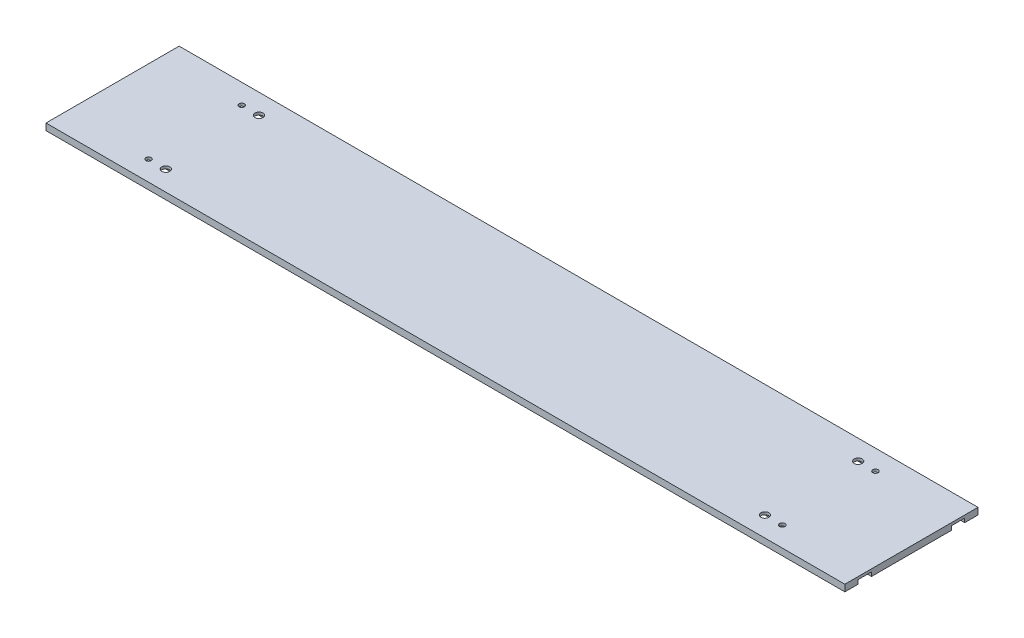
ISO-10303-21;
HEADER;
FILE_DESCRIPTION(('STEP AP214'),'2;1');
FILE_NAME('part.step','',(''),(''),'','','');
FILE_SCHEMA(('AUTOMOTIVE_DESIGN { 1 0 10303 214 1 1 1 1 }'));
ENDSEC;
DATA;
#1=APPLICATION_CONTEXT('core data for automotive mechanical design processes');
#2=APPLICATION_PROTOCOL_DEFINITION('international standard','automotive_design',2000,#1);
#3=PRODUCT_CONTEXT('',#1,'mechanical');
#4=PRODUCT('Part','Part','',(#3));
#5=PRODUCT_RELATED_PRODUCT_CATEGORY('part','',(#4));
#6=PRODUCT_DEFINITION_FORMATION('','',#4);
#7=PRODUCT_DEFINITION_CONTEXT('part definition',#1,'design');
#8=PRODUCT_DEFINITION('design','',#6,#7);
#9=PRODUCT_DEFINITION_SHAPE('','',#8);
#10=(LENGTH_UNIT() NAMED_UNIT(*) SI_UNIT(.MILLI.,.METRE.));
#11=(NAMED_UNIT(*) PLANE_ANGLE_UNIT() SI_UNIT($,.RADIAN.));
#12=(NAMED_UNIT(*) SI_UNIT($,.STERADIAN.) SOLID_ANGLE_UNIT());
#13=UNCERTAINTY_MEASURE_WITH_UNIT(LENGTH_MEASURE(1.E-05),#10,'distance_accuracy_value','');
#14=(GEOMETRIC_REPRESENTATION_CONTEXT(3) GLOBAL_UNCERTAINTY_ASSIGNED_CONTEXT((#13)) GLOBAL_UNIT_ASSIGNED_CONTEXT((#10,
#11,#12)) REPRESENTATION_CONTEXT('',''));
#15=CARTESIAN_POINT('',(0.,0.,0.));
#16=DIRECTION('',(0.,0.,1.));
#17=DIRECTION('',(1.,0.,0.));
#18=AXIS2_PLACEMENT_3D('',#15,#16,#17);
#19=CARTESIAN_POINT('',(0.,0.,-100.));
#20=DIRECTION('',(0.,-1.,0.));
#21=DIRECTION('',(0.,0.,-1.));
#22=AXIS2_PLACEMENT_3D('',#19,#20,#21);
#23=PLANE('',#22);
#24=DIRECTION('',(-1.,0.,0.));
#25=VECTOR('',#24,1.);
#26=CARTESIAN_POINT('',(0.,0.,-80.));
#27=LINE('',#26,#25);
#28=CARTESIAN_POINT('',(600.,0.,-80.));
#29=VERTEX_POINT('',#28);
#30=CARTESIAN_POINT('',(0.,0.,-80.));
#31=VERTEX_POINT('',#30);
#32=EDGE_CURVE('E135',#29,#31,#27,.T.);
#33=ORIENTED_EDGE('',*,*,#32,.F.);
#34=DIRECTION('',(0.,0.,1.));
#35=VECTOR('',#34,1.);
#36=CARTESIAN_POINT('',(600.,0.,-100.));
#37=LINE('',#36,#35);
#38=CARTESIAN_POINT('',(600.,0.,-20.));
#39=VERTEX_POINT('',#38);
#40=EDGE_CURVE('E306',#29,#39,#37,.T.);
#41=ORIENTED_EDGE('',*,*,#40,.T.);
#42=DIRECTION('',(1.,0.,0.));
#43=VECTOR('',#42,1.);
#44=CARTESIAN_POINT('',(600.,0.,-20.));
#45=LINE('',#44,#43);
#46=CARTESIAN_POINT('',(0.,0.,-20.));
#47=VERTEX_POINT('',#46);
#48=EDGE_CURVE('E194',#47,#39,#45,.T.);
#49=ORIENTED_EDGE('',*,*,#48,.F.);
#50=DIRECTION('',(0.,0.,1.));
#51=VECTOR('',#50,1.);
#52=CARTESIAN_POINT('',(0.,0.,-100.));
#53=LINE('',#52,#51);
#54=EDGE_CURVE('E310',#31,#47,#53,.T.);
#55=ORIENTED_EDGE('',*,*,#54,.F.);
#56=EDGE_LOOP('',(#33,#41,#49,#55));
#57=FACE_BOUND('',#56,.T.);
#58=ADVANCED_FACE('F39',(#57),#23,.T.);
#59=DIRECTION('',(-1.,0.,0.));
#60=VECTOR('',#59,1.);
#61=CARTESIAN_POINT('',(0.,0.,-10.));
#62=LINE('',#61,#60);
#63=CARTESIAN_POINT('',(600.,0.,-10.));
#64=VERTEX_POINT('',#63);
#65=CARTESIAN_POINT('',(0.,0.,-10.));
#66=VERTEX_POINT('',#65);
#67=EDGE_CURVE('E183',#64,#66,#62,.T.);
#68=ORIENTED_EDGE('',*,*,#67,.F.);
#69=CARTESIAN_POINT('',(600.,0.,0.));
#70=VERTEX_POINT('',#69);
#71=EDGE_CURVE('E307',#64,#70,#37,.T.);
#72=ORIENTED_EDGE('',*,*,#71,.T.);
#73=DIRECTION('',(1.,0.,0.));
#74=VECTOR('',#73,1.);
#75=CARTESIAN_POINT('',(0.,0.,0.));
#76=LINE('',#75,#74);
#77=CARTESIAN_POINT('',(0.,0.,0.));
#78=VERTEX_POINT('',#77);
#79=EDGE_CURVE('E289',#78,#70,#76,.T.);
#80=ORIENTED_EDGE('',*,*,#79,.F.);
#81=EDGE_CURVE('E285',#66,#78,#53,.T.);
#82=ORIENTED_EDGE('',*,*,#81,.F.);
#83=EDGE_LOOP('',(#68,#72,#80,#82));
#84=FACE_BOUND('',#83,.T.);
#85=ADVANCED_FACE('F365',(#84),#23,.T.);
#86=CARTESIAN_POINT('',(0.,4.99999999999994,-100.));
#87=DIRECTION('',(-1.,0.,0.));
#88=DIRECTION('',(0.,-1.,0.));
#89=AXIS2_PLACEMENT_3D('',#86,#87,#88);
#90=PLANE('',#89);
#91=DIRECTION('',(0.,-1.,0.));
#92=VECTOR('',#91,1.);
#93=CARTESIAN_POINT('',(0.,3.,-80.));
#94=LINE('',#93,#92);
#95=CARTESIAN_POINT('',(0.,3.,-80.));
#96=VERTEX_POINT('',#95);
#97=EDGE_CURVE('E129',#96,#31,#94,.T.);
#98=ORIENTED_EDGE('',*,*,#97,.T.);
#99=ORIENTED_EDGE('',*,*,#54,.T.);
#100=DIRECTION('',(0.,-1.,0.));
#101=VECTOR('',#100,1.);
#102=CARTESIAN_POINT('',(0.,3.,-20.));
#103=LINE('',#102,#101);
#104=CARTESIAN_POINT('',(0.,3.,-20.));
#105=VERTEX_POINT('',#104);
#106=EDGE_CURVE('E57',#105,#47,#103,.T.);
#107=ORIENTED_EDGE('',*,*,#106,.F.);
#108=DIRECTION('',(0.,0.,-1.));
#109=VECTOR('',#108,1.);
#110=CARTESIAN_POINT('',(0.,3.,-10.));
#111=LINE('',#110,#109);
#112=CARTESIAN_POINT('',(0.,3.,-10.));
#113=VERTEX_POINT('',#112);
#114=EDGE_CURVE('E178',#113,#105,#111,.T.);
#115=ORIENTED_EDGE('',*,*,#114,.F.);
#116=DIRECTION('',(0.,-1.,0.));
#117=VECTOR('',#116,1.);
#118=CARTESIAN_POINT('',(0.,3.,-10.));
#119=LINE('',#118,#117);
#120=EDGE_CURVE('E165',#113,#66,#119,.T.);
#121=ORIENTED_EDGE('',*,*,#120,.T.);
#122=ORIENTED_EDGE('',*,*,#81,.T.);
#123=DIRECTION('',(0.,-1.,0.));
#124=VECTOR('',#123,1.);
#125=CARTESIAN_POINT('',(0.,4.99999999999994,0.));
#126=LINE('',#125,#124);
#127=CARTESIAN_POINT('',(0.,4.99999999999994,0.));
#128=VERTEX_POINT('',#127);
#129=EDGE_CURVE('E267',#128,#78,#126,.T.);
#130=ORIENTED_EDGE('',*,*,#129,.F.);
#131=DIRECTION('',(0.,0.,1.));
#132=VECTOR('',#131,1.);
#133=CARTESIAN_POINT('',(0.,4.99999999999994,-100.));
#134=LINE('',#133,#132);
#135=CARTESIAN_POINT('',(0.,4.99999999999994,-100.));
#136=VERTEX_POINT('',#135);
#137=EDGE_CURVE('E11',#136,#128,#134,.T.);
#138=ORIENTED_EDGE('',*,*,#137,.F.);
#139=DIRECTION('',(0.,-1.,0.));
#140=VECTOR('',#139,1.);
#141=CARTESIAN_POINT('',(0.,4.99999999999994,-100.));
#142=LINE('',#141,#140);
#143=CARTESIAN_POINT('',(0.,0.,-100.));
#144=VERTEX_POINT('',#143);
#145=EDGE_CURVE('E268',#136,#144,#142,.T.);
#146=ORIENTED_EDGE('',*,*,#145,.T.);
#147=CARTESIAN_POINT('',(0.,0.,-90.));
#148=VERTEX_POINT('',#147);
#149=EDGE_CURVE('E308',#144,#148,#53,.T.);
#150=ORIENTED_EDGE('',*,*,#149,.T.);
#151=DIRECTION('',(0.,-1.,0.));
#152=VECTOR('',#151,1.);
#153=CARTESIAN_POINT('',(0.,3.,-90.));
#154=LINE('',#153,#152);
#155=CARTESIAN_POINT('',(0.,3.,-90.));
#156=VERTEX_POINT('',#155);
#157=EDGE_CURVE('E65',#156,#148,#154,.T.);
#158=ORIENTED_EDGE('',*,*,#157,.F.);
#159=DIRECTION('',(0.,0.,-1.));
#160=VECTOR('',#159,1.);
#161=CARTESIAN_POINT('',(0.,3.,-80.));
#162=LINE('',#161,#160);
#163=EDGE_CURVE('E148',#96,#156,#162,.T.);
#164=ORIENTED_EDGE('',*,*,#163,.F.);
#165=EDGE_LOOP('',(#98,#99,#107,#115,#121,#122,#130,#138,#146,#150,#158,#164));
#166=FACE_BOUND('',#165,.T.);
#167=ADVANCED_FACE('F41',(#166),#90,.T.);
#168=CARTESIAN_POINT('',(600.,5.,-100.));
#169=DIRECTION('',(0.,1.,0.));
#170=DIRECTION('',(-1.,0.,0.));
#171=AXIS2_PLACEMENT_3D('',#168,#169,#170);
#172=PLANE('',#171);
#173=CARTESIAN_POINT('',(74.9999999999999,4.99999999999994,-15.));
#174=DIRECTION('',(0.,1.,0.));
#175=DIRECTION('',(-1.,0.,0.));
#176=AXIS2_PLACEMENT_3D('',#173,#174,#175);
#177=CIRCLE('',#176,3.00000000000001);
#178=CARTESIAN_POINT('',(71.9999999999999,4.99999999999994,-15.));
#179=VERTEX_POINT('',#178);
#180=EDGE_CURVE('E240',#179,#179,#177,.T.);
#181=ORIENTED_EDGE('',*,*,#180,.F.);
#182=EDGE_LOOP('',(#181));
#183=FACE_BOUND('',#182,.T.);
#184=CARTESIAN_POINT('',(525.,4.99999999999999,-85.));
#185=DIRECTION('',(0.,1.,0.));
#186=DIRECTION('',(-1.,0.,0.));
#187=AXIS2_PLACEMENT_3D('',#184,#185,#186);
#188=CIRCLE('',#187,3.00000000000005);
#189=CARTESIAN_POINT('',(522.,4.99999999999999,-85.));
#190=VERTEX_POINT('',#189);
#191=EDGE_CURVE('E239',#190,#190,#188,.T.);
#192=ORIENTED_EDGE('',*,*,#191,.F.);
#193=EDGE_LOOP('',(#192));
#194=FACE_BOUND('',#193,.T.);
#195=CARTESIAN_POINT('',(525.,4.99999999999999,-15.));
#196=DIRECTION('',(0.,1.,0.));
#197=DIRECTION('',(-1.,0.,0.));
#198=AXIS2_PLACEMENT_3D('',#195,#196,#197);
#199=CIRCLE('',#198,3.00000000000005);
#200=CARTESIAN_POINT('',(522.,4.99999999999999,-15.));
#201=VERTEX_POINT('',#200);
#202=EDGE_CURVE('E235',#201,#201,#199,.T.);
#203=ORIENTED_EDGE('',*,*,#202,.F.);
#204=EDGE_LOOP('',(#203));
#205=FACE_BOUND('',#204,.T.);
#206=CARTESIAN_POINT('',(74.9999999999999,4.99999999999994,-85.));
#207=DIRECTION('',(0.,1.,0.));
#208=DIRECTION('',(-1.,0.,0.));
#209=AXIS2_PLACEMENT_3D('',#206,#207,#208);
#210=CIRCLE('',#209,3.00000000000001);
#211=CARTESIAN_POINT('',(71.9999999999999,4.99999999999994,-85.));
#212=VERTEX_POINT('',#211);
#213=EDGE_CURVE('E244',#212,#212,#210,.T.);
#214=ORIENTED_EDGE('',*,*,#213,.F.);
#215=EDGE_LOOP('',(#214));
#216=FACE_BOUND('',#215,.T.);
#217=CARTESIAN_POINT('',(62.,4.99999999999994,-15.));
#218=DIRECTION('',(0.,1.,0.));
#219=DIRECTION('',(-1.,0.,0.));
#220=AXIS2_PLACEMENT_3D('',#217,#218,#219);
#221=CIRCLE('',#220,2.);
#222=CARTESIAN_POINT('',(60.,4.99999999999994,-15.));
#223=VERTEX_POINT('',#222);
#224=EDGE_CURVE('E256',#223,#223,#221,.T.);
#225=ORIENTED_EDGE('',*,*,#224,.F.);
#226=EDGE_LOOP('',(#225));
#227=FACE_BOUND('',#226,.T.);
#228=CARTESIAN_POINT('',(538.,4.99999999999999,-85.));
#229=DIRECTION('',(0.,1.,0.));
#230=DIRECTION('',(-1.,0.,0.));
#231=AXIS2_PLACEMENT_3D('',#228,#229,#230);
#232=CIRCLE('',#231,2.);
#233=CARTESIAN_POINT('',(536.,4.99999999999999,-85.));
#234=VERTEX_POINT('',#233);
#235=EDGE_CURVE('E255',#234,#234,#232,.T.);
#236=ORIENTED_EDGE('',*,*,#235,.F.);
#237=EDGE_LOOP('',(#236));
#238=FACE_BOUND('',#237,.T.);
#239=CARTESIAN_POINT('',(538.,4.99999999999999,-15.));
#240=DIRECTION('',(0.,1.,0.));
#241=DIRECTION('',(-1.,0.,0.));
#242=AXIS2_PLACEMENT_3D('',#239,#240,#241);
#243=CIRCLE('',#242,2.);
#244=CARTESIAN_POINT('',(536.,4.99999999999999,-15.));
#245=VERTEX_POINT('',#244);
#246=EDGE_CURVE('E251',#245,#245,#243,.T.);
#247=ORIENTED_EDGE('',*,*,#246,.F.);
#248=EDGE_LOOP('',(#247));
#249=FACE_BOUND('',#248,.T.);
#250=CARTESIAN_POINT('',(61.9999999999999,4.99999999999994,-85.));
#251=DIRECTION('',(0.,1.,0.));
#252=DIRECTION('',(-1.,0.,0.));
#253=AXIS2_PLACEMENT_3D('',#250,#251,#252);
#254=CIRCLE('',#253,2.);
#255=CARTESIAN_POINT('',(59.9999999999999,4.99999999999994,-85.));
#256=VERTEX_POINT('',#255);
#257=EDGE_CURVE('E260',#256,#256,#254,.T.);
#258=ORIENTED_EDGE('',*,*,#257,.F.);
#259=EDGE_LOOP('',(#258));
#260=FACE_BOUND('',#259,.T.);
#261=DIRECTION('',(-1.,0.,0.));
#262=VECTOR('',#261,1.);
#263=CARTESIAN_POINT('',(600.,5.,0.));
#264=LINE('',#263,#262);
#265=CARTESIAN_POINT('',(600.,5.,0.));
#266=VERTEX_POINT('',#265);
#267=EDGE_CURVE('E273',#266,#128,#264,.T.);
#268=ORIENTED_EDGE('',*,*,#267,.F.);
#269=DIRECTION('',(0.,0.,1.));
#270=VECTOR('',#269,1.);
#271=CARTESIAN_POINT('',(600.,5.,-100.));
#272=LINE('',#271,#270);
#273=CARTESIAN_POINT('',(600.,5.,-100.));
#274=VERTEX_POINT('',#273);
#275=EDGE_CURVE('E49',#274,#266,#272,.T.);
#276=ORIENTED_EDGE('',*,*,#275,.F.);
#277=DIRECTION('',(-1.,0.,0.));
#278=VECTOR('',#277,1.);
#279=CARTESIAN_POINT('',(600.,5.,-100.));
#280=LINE('',#279,#278);
#281=EDGE_CURVE('E281',#274,#136,#280,.T.);
#282=ORIENTED_EDGE('',*,*,#281,.T.);
#283=ORIENTED_EDGE('',*,*,#137,.T.);
#284=EDGE_LOOP('',(#268,#276,#282,#283));
#285=FACE_BOUND('',#284,.T.);
#286=ADVANCED_FACE('F338',(#183,#194,#205,#216,#227,#238,#249,#260,#285),#172,.T.);
#287=CARTESIAN_POINT('',(600.,0.,-100.));
#288=DIRECTION('',(1.,0.,0.));
#289=DIRECTION('',(0.,0.,-1.));
#290=AXIS2_PLACEMENT_3D('',#287,#288,#289);
#291=PLANE('',#290);
#292=DIRECTION('',(0.,-1.,0.));
#293=VECTOR('',#292,1.);
#294=CARTESIAN_POINT('',(600.,3.,-80.));
#295=LINE('',#294,#293);
#296=CARTESIAN_POINT('',(600.,3.,-80.));
#297=VERTEX_POINT('',#296);
#298=EDGE_CURVE('E168',#297,#29,#295,.T.);
#299=ORIENTED_EDGE('',*,*,#298,.F.);
#300=DIRECTION('',(0.,0.,1.));
#301=VECTOR('',#300,1.);
#302=CARTESIAN_POINT('',(600.,3.,-80.));
#303=LINE('',#302,#301);
#304=CARTESIAN_POINT('',(600.,3.,-90.));
#305=VERTEX_POINT('',#304);
#306=EDGE_CURVE('E141',#305,#297,#303,.T.);
#307=ORIENTED_EDGE('',*,*,#306,.F.);
#308=DIRECTION('',(0.,-1.,0.));
#309=VECTOR('',#308,1.);
#310=CARTESIAN_POINT('',(600.,3.,-90.));
#311=LINE('',#310,#309);
#312=CARTESIAN_POINT('',(600.,0.,-90.));
#313=VERTEX_POINT('',#312);
#314=EDGE_CURVE('E172',#305,#313,#311,.T.);
#315=ORIENTED_EDGE('',*,*,#314,.T.);
#316=CARTESIAN_POINT('',(600.,0.,-100.));
#317=VERTEX_POINT('',#316);
#318=EDGE_CURVE('E302',#317,#313,#37,.T.);
#319=ORIENTED_EDGE('',*,*,#318,.F.);
#320=DIRECTION('',(0.,1.,0.));
#321=VECTOR('',#320,1.);
#322=CARTESIAN_POINT('',(600.,0.,-100.));
#323=LINE('',#322,#321);
#324=EDGE_CURVE('E277',#317,#274,#323,.T.);
#325=ORIENTED_EDGE('',*,*,#324,.T.);
#326=ORIENTED_EDGE('',*,*,#275,.T.);
#327=DIRECTION('',(0.,1.,0.));
#328=VECTOR('',#327,1.);
#329=CARTESIAN_POINT('',(600.,0.,0.));
#330=LINE('',#329,#328);
#331=EDGE_CURVE('E293',#70,#266,#330,.T.);
#332=ORIENTED_EDGE('',*,*,#331,.F.);
#333=ORIENTED_EDGE('',*,*,#71,.F.);
#334=DIRECTION('',(0.,-1.,0.));
#335=VECTOR('',#334,1.);
#336=CARTESIAN_POINT('',(600.,3.,-10.));
#337=LINE('',#336,#335);
#338=CARTESIAN_POINT('',(600.,3.,-10.));
#339=VERTEX_POINT('',#338);
#340=EDGE_CURVE('E202',#339,#64,#337,.T.);
#341=ORIENTED_EDGE('',*,*,#340,.F.);
#342=DIRECTION('',(0.,0.,1.));
#343=VECTOR('',#342,1.);
#344=CARTESIAN_POINT('',(600.,3.,-10.));
#345=LINE('',#344,#343);
#346=CARTESIAN_POINT('',(600.,3.,-20.));
#347=VERTEX_POINT('',#346);
#348=EDGE_CURVE('E187',#347,#339,#345,.T.);
#349=ORIENTED_EDGE('',*,*,#348,.F.);
#350=DIRECTION('',(0.,-1.,0.));
#351=VECTOR('',#350,1.);
#352=CARTESIAN_POINT('',(600.,3.,-20.));
#353=LINE('',#352,#351);
#354=EDGE_CURVE('E205',#347,#39,#353,.T.);
#355=ORIENTED_EDGE('',*,*,#354,.T.);
#356=ORIENTED_EDGE('',*,*,#40,.F.);
#357=EDGE_LOOP('',(#299,#307,#315,#319,#325,#326,#332,#333,#341,#349,#355,#356));
#358=FACE_BOUND('',#357,.T.);
#359=ADVANCED_FACE('F341',(#358),#291,.T.);
#360=DIRECTION('',(1.,0.,0.));
#361=VECTOR('',#360,1.);
#362=CARTESIAN_POINT('',(0.,0.,-90.));
#363=LINE('',#362,#361);
#364=EDGE_CURVE('E152',#148,#313,#363,.T.);
#365=ORIENTED_EDGE('',*,*,#364,.F.);
#366=ORIENTED_EDGE('',*,*,#149,.F.);
#367=DIRECTION('',(1.,0.,0.));
#368=VECTOR('',#367,1.);
#369=CARTESIAN_POINT('',(0.,0.,-100.));
#370=LINE('',#369,#368);
#371=EDGE_CURVE('E272',#144,#317,#370,.T.);
#372=ORIENTED_EDGE('',*,*,#371,.T.);
#373=ORIENTED_EDGE('',*,*,#318,.T.);
#374=EDGE_LOOP('',(#365,#366,#372,#373));
#375=FACE_BOUND('',#374,.T.);
#376=ADVANCED_FACE('F382',(#375),#23,.T.);
#377=CARTESIAN_POINT('',(0.,0.,-100.));
#378=DIRECTION('',(0.,0.,1.));
#379=DIRECTION('',(1.,0.,0.));
#380=AXIS2_PLACEMENT_3D('',#377,#378,#379);
#381=PLANE('',#380);
#382=ORIENTED_EDGE('',*,*,#145,.F.);
#383=ORIENTED_EDGE('',*,*,#281,.F.);
#384=ORIENTED_EDGE('',*,*,#324,.F.);
#385=ORIENTED_EDGE('',*,*,#371,.F.);
#386=EDGE_LOOP('',(#382,#383,#384,#385));
#387=FACE_BOUND('',#386,.T.);
#388=ADVANCED_FACE('F360',(#387),#381,.F.);
#389=CARTESIAN_POINT('',(0.,0.,0.));
#390=DIRECTION('',(0.,0.,1.));
#391=DIRECTION('',(1.,0.,0.));
#392=AXIS2_PLACEMENT_3D('',#389,#390,#391);
#393=PLANE('',#392);
#394=ORIENTED_EDGE('',*,*,#129,.T.);
#395=ORIENTED_EDGE('',*,*,#79,.T.);
#396=ORIENTED_EDGE('',*,*,#331,.T.);
#397=ORIENTED_EDGE('',*,*,#267,.T.);
#398=EDGE_LOOP('',(#394,#395,#396,#397));
#399=FACE_BOUND('',#398,.T.);
#400=ADVANCED_FACE('F349',(#399),#393,.T.);
#401=CARTESIAN_POINT('',(61.9999999999999,0.,-85.));
#402=DIRECTION('',(0.,1.,0.));
#403=DIRECTION('',(-1.,0.,0.));
#404=AXIS2_PLACEMENT_3D('',#401,#402,#403);
#405=CYLINDRICAL_SURFACE('',#404,2.);
#406=CARTESIAN_POINT('',(61.9999999999999,3.,-85.));
#407=DIRECTION('',(0.,1.,0.));
#408=DIRECTION('',(0.,0.,1.));
#409=AXIS2_PLACEMENT_3D('',#406,#407,#408);
#410=CIRCLE('',#409,2.);
#411=CARTESIAN_POINT('',(61.9999999999999,3.,-83.));
#412=VERTEX_POINT('',#411);
#413=EDGE_CURVE('E231',#412,#412,#410,.F.);
#414=ORIENTED_EDGE('',*,*,#413,.T.);
#415=EDGE_LOOP('',(#414));
#416=FACE_BOUND('',#415,.T.);
#417=ORIENTED_EDGE('',*,*,#257,.T.);
#418=EDGE_LOOP('',(#417));
#419=FACE_BOUND('',#418,.T.);
#420=ADVANCED_FACE('F334',(#416,#419),#405,.F.);
#421=CARTESIAN_POINT('',(538.,0.,-15.));
#422=DIRECTION('',(0.,1.,0.));
#423=DIRECTION('',(-1.,0.,0.));
#424=AXIS2_PLACEMENT_3D('',#421,#422,#423);
#425=CYLINDRICAL_SURFACE('',#424,2.);
#426=CARTESIAN_POINT('',(538.,3.,-15.));
#427=DIRECTION('',(0.,1.,0.));
#428=DIRECTION('',(0.,0.,1.));
#429=AXIS2_PLACEMENT_3D('',#426,#427,#428);
#430=CIRCLE('',#429,2.);
#431=CARTESIAN_POINT('',(538.,3.,-13.));
#432=VERTEX_POINT('',#431);
#433=EDGE_CURVE('E219',#432,#432,#430,.F.);
#434=ORIENTED_EDGE('',*,*,#433,.T.);
#435=EDGE_LOOP('',(#434));
#436=FACE_BOUND('',#435,.T.);
#437=ORIENTED_EDGE('',*,*,#246,.T.);
#438=EDGE_LOOP('',(#437));
#439=FACE_BOUND('',#438,.T.);
#440=ADVANCED_FACE('F330',(#436,#439),#425,.F.);
#441=CARTESIAN_POINT('',(538.,0.,-85.));
#442=DIRECTION('',(0.,1.,0.));
#443=DIRECTION('',(-1.,0.,0.));
#444=AXIS2_PLACEMENT_3D('',#441,#442,#443);
#445=CYLINDRICAL_SURFACE('',#444,2.);
#446=CARTESIAN_POINT('',(538.,3.,-85.));
#447=DIRECTION('',(0.,1.,0.));
#448=DIRECTION('',(0.,0.,1.));
#449=AXIS2_PLACEMENT_3D('',#446,#447,#448);
#450=CIRCLE('',#449,2.);
#451=CARTESIAN_POINT('',(538.,3.,-83.));
#452=VERTEX_POINT('',#451);
#453=EDGE_CURVE('E227',#452,#452,#450,.F.);
#454=ORIENTED_EDGE('',*,*,#453,.T.);
#455=EDGE_LOOP('',(#454));
#456=FACE_BOUND('',#455,.T.);
#457=ORIENTED_EDGE('',*,*,#235,.T.);
#458=EDGE_LOOP('',(#457));
#459=FACE_BOUND('',#458,.T.);
#460=ADVANCED_FACE('F333',(#456,#459),#445,.F.);
#461=CARTESIAN_POINT('',(62.,0.,-15.));
#462=DIRECTION('',(0.,1.,0.));
#463=DIRECTION('',(-1.,0.,0.));
#464=AXIS2_PLACEMENT_3D('',#461,#462,#463);
#465=CYLINDRICAL_SURFACE('',#464,2.);
#466=CARTESIAN_POINT('',(62.,3.,-15.));
#467=DIRECTION('',(0.,1.,0.));
#468=DIRECTION('',(0.,0.,1.));
#469=AXIS2_PLACEMENT_3D('',#466,#467,#468);
#470=CIRCLE('',#469,2.);
#471=CARTESIAN_POINT('',(62.,3.,-13.));
#472=VERTEX_POINT('',#471);
#473=EDGE_CURVE('E215',#472,#472,#470,.F.);
#474=ORIENTED_EDGE('',*,*,#473,.T.);
#475=EDGE_LOOP('',(#474));
#476=FACE_BOUND('',#475,.T.);
#477=ORIENTED_EDGE('',*,*,#224,.T.);
#478=EDGE_LOOP('',(#477));
#479=FACE_BOUND('',#478,.T.);
#480=ADVANCED_FACE('F430',(#476,#479),#465,.F.);
#481=CARTESIAN_POINT('',(74.9999999999999,-1.17093834628434E-13,-85.));
#482=DIRECTION('',(0.,1.,0.));
#483=DIRECTION('',(-1.,0.,0.));
#484=AXIS2_PLACEMENT_3D('',#481,#482,#483);
#485=CYLINDRICAL_SURFACE('',#484,3.00000000000001);
#486=CARTESIAN_POINT('',(74.9999999999999,3.,-85.));
#487=DIRECTION('',(0.,1.,0.));
#488=DIRECTION('',(0.,0.,1.));
#489=AXIS2_PLACEMENT_3D('',#486,#487,#488);
#490=CIRCLE('',#489,3.00000000000001);
#491=CARTESIAN_POINT('',(74.9999999999999,3.,-82.));
#492=VERTEX_POINT('',#491);
#493=EDGE_CURVE('E223',#492,#492,#490,.F.);
#494=ORIENTED_EDGE('',*,*,#493,.T.);
#495=EDGE_LOOP('',(#494));
#496=FACE_BOUND('',#495,.T.);
#497=ORIENTED_EDGE('',*,*,#213,.T.);
#498=EDGE_LOOP('',(#497));
#499=FACE_BOUND('',#498,.T.);
#500=ADVANCED_FACE('F436',(#496,#499),#485,.F.);
#501=CARTESIAN_POINT('',(525.,0.,-15.));
#502=DIRECTION('',(0.,1.,0.));
#503=DIRECTION('',(-1.,0.,0.));
#504=AXIS2_PLACEMENT_3D('',#501,#502,#503);
#505=CYLINDRICAL_SURFACE('',#504,3.00000000000005);
#506=CARTESIAN_POINT('',(525.,3.,-15.));
#507=DIRECTION('',(0.,1.,0.));
#508=DIRECTION('',(0.,0.,1.));
#509=AXIS2_PLACEMENT_3D('',#506,#507,#508);
#510=CIRCLE('',#509,3.00000000000005);
#511=CARTESIAN_POINT('',(525.,3.,-12.));
#512=VERTEX_POINT('',#511);
#513=EDGE_CURVE('E211',#512,#512,#510,.F.);
#514=ORIENTED_EDGE('',*,*,#513,.T.);
#515=EDGE_LOOP('',(#514));
#516=FACE_BOUND('',#515,.T.);
#517=ORIENTED_EDGE('',*,*,#202,.T.);
#518=EDGE_LOOP('',(#517));
#519=FACE_BOUND('',#518,.T.);
#520=ADVANCED_FACE('F416',(#516,#519),#505,.F.);
#521=CARTESIAN_POINT('',(525.,0.,-85.));
#522=DIRECTION('',(0.,1.,0.));
#523=DIRECTION('',(-1.,0.,0.));
#524=AXIS2_PLACEMENT_3D('',#521,#522,#523);
#525=CYLINDRICAL_SURFACE('',#524,3.00000000000005);
#526=CARTESIAN_POINT('',(525.,3.,-85.));
#527=DIRECTION('',(0.,1.,0.));
#528=DIRECTION('',(0.,0.,1.));
#529=AXIS2_PLACEMENT_3D('',#526,#527,#528);
#530=CIRCLE('',#529,3.00000000000005);
#531=CARTESIAN_POINT('',(525.,3.,-81.9999999999999));
#532=VERTEX_POINT('',#531);
#533=EDGE_CURVE('E43',#532,#532,#530,.F.);
#534=ORIENTED_EDGE('',*,*,#533,.T.);
#535=EDGE_LOOP('',(#534));
#536=FACE_BOUND('',#535,.T.);
#537=ORIENTED_EDGE('',*,*,#191,.T.);
#538=EDGE_LOOP('',(#537));
#539=FACE_BOUND('',#538,.T.);
#540=ADVANCED_FACE('F413',(#536,#539),#525,.F.);
#541=CARTESIAN_POINT('',(74.9999999999999,-1.17093834628434E-13,-15.));
#542=DIRECTION('',(0.,1.,0.));
#543=DIRECTION('',(-1.,0.,0.));
#544=AXIS2_PLACEMENT_3D('',#541,#542,#543);
#545=CYLINDRICAL_SURFACE('',#544,3.00000000000001);
#546=CARTESIAN_POINT('',(74.9999999999999,3.,-15.));
#547=DIRECTION('',(0.,1.,0.));
#548=DIRECTION('',(0.,0.,1.));
#549=AXIS2_PLACEMENT_3D('',#546,#547,#548);
#550=CIRCLE('',#549,3.00000000000001);
#551=CARTESIAN_POINT('',(74.9999999999999,3.,-12.));
#552=VERTEX_POINT('',#551);
#553=EDGE_CURVE('E171',#552,#552,#550,.F.);
#554=ORIENTED_EDGE('',*,*,#553,.T.);
#555=EDGE_LOOP('',(#554));
#556=FACE_BOUND('',#555,.T.);
#557=ORIENTED_EDGE('',*,*,#180,.T.);
#558=EDGE_LOOP('',(#557));
#559=FACE_BOUND('',#558,.T.);
#560=ADVANCED_FACE('F315',(#556,#559),#545,.F.);
#561=CARTESIAN_POINT('',(0.,3.,0.));
#562=DIRECTION('',(0.,1.,0.));
#563=DIRECTION('',(0.,0.,1.));
#564=AXIS2_PLACEMENT_3D('',#561,#562,#563);
#565=PLANE('',#564);
#566=ORIENTED_EDGE('',*,*,#473,.F.);
#567=EDGE_LOOP('',(#566));
#568=FACE_BOUND('',#567,.T.);
#569=ORIENTED_EDGE('',*,*,#553,.F.);
#570=EDGE_LOOP('',(#569));
#571=FACE_BOUND('',#570,.T.);
#572=ORIENTED_EDGE('',*,*,#114,.T.);
#573=DIRECTION('',(1.,0.,0.));
#574=VECTOR('',#573,1.);
#575=CARTESIAN_POINT('',(600.,3.,-20.));
#576=LINE('',#575,#574);
#577=EDGE_CURVE('E182',#105,#347,#576,.T.);
#578=ORIENTED_EDGE('',*,*,#577,.T.);
#579=ORIENTED_EDGE('',*,*,#348,.T.);
#580=DIRECTION('',(-1.,0.,0.));
#581=VECTOR('',#580,1.);
#582=CARTESIAN_POINT('',(0.,3.,-10.));
#583=LINE('',#582,#581);
#584=EDGE_CURVE('E190',#339,#113,#583,.T.);
#585=ORIENTED_EDGE('',*,*,#584,.T.);
#586=EDGE_LOOP('',(#572,#578,#579,#585));
#587=FACE_BOUND('',#586,.T.);
#588=ORIENTED_EDGE('',*,*,#513,.F.);
#589=EDGE_LOOP('',(#588));
#590=FACE_BOUND('',#589,.T.);
#591=ORIENTED_EDGE('',*,*,#433,.F.);
#592=EDGE_LOOP('',(#591));
#593=FACE_BOUND('',#592,.T.);
#594=ADVANCED_FACE('F318',(#568,#571,#587,#590,#593),#565,.F.);
#595=CARTESIAN_POINT('',(0.,3.,-10.));
#596=DIRECTION('',(0.,0.,1.));
#597=DIRECTION('',(1.,0.,0.));
#598=AXIS2_PLACEMENT_3D('',#595,#596,#597);
#599=PLANE('',#598);
#600=ORIENTED_EDGE('',*,*,#67,.T.);
#601=ORIENTED_EDGE('',*,*,#120,.F.);
#602=ORIENTED_EDGE('',*,*,#584,.F.);
#603=ORIENTED_EDGE('',*,*,#340,.T.);
#604=EDGE_LOOP('',(#600,#601,#602,#603));
#605=FACE_BOUND('',#604,.T.);
#606=ADVANCED_FACE('F321',(#605),#599,.F.);
#607=CARTESIAN_POINT('',(600.,3.,-20.));
#608=DIRECTION('',(0.,0.,-1.));
#609=DIRECTION('',(-1.,0.,0.));
#610=AXIS2_PLACEMENT_3D('',#607,#608,#609);
#611=PLANE('',#610);
#612=ORIENTED_EDGE('',*,*,#48,.T.);
#613=ORIENTED_EDGE('',*,*,#354,.F.);
#614=ORIENTED_EDGE('',*,*,#577,.F.);
#615=ORIENTED_EDGE('',*,*,#106,.T.);
#616=EDGE_LOOP('',(#612,#613,#614,#615));
#617=FACE_BOUND('',#616,.T.);
#618=ADVANCED_FACE('F372',(#617),#611,.F.);
#619=CARTESIAN_POINT('',(0.,3.,0.));
#620=DIRECTION('',(0.,1.,0.));
#621=DIRECTION('',(0.,0.,1.));
#622=AXIS2_PLACEMENT_3D('',#619,#620,#621);
#623=PLANE('',#622);
#624=ORIENTED_EDGE('',*,*,#453,.F.);
#625=EDGE_LOOP('',(#624));
#626=FACE_BOUND('',#625,.T.);
#627=ORIENTED_EDGE('',*,*,#533,.F.);
#628=EDGE_LOOP('',(#627));
#629=FACE_BOUND('',#628,.T.);
#630=DIRECTION('',(-1.,0.,0.));
#631=VECTOR('',#630,1.);
#632=CARTESIAN_POINT('',(0.,3.,-80.));
#633=LINE('',#632,#631);
#634=EDGE_CURVE('E132',#297,#96,#633,.T.);
#635=ORIENTED_EDGE('',*,*,#634,.T.);
#636=ORIENTED_EDGE('',*,*,#163,.T.);
#637=DIRECTION('',(1.,0.,0.));
#638=VECTOR('',#637,1.);
#639=CARTESIAN_POINT('',(0.,3.,-90.));
#640=LINE('',#639,#638);
#641=EDGE_CURVE('E156',#156,#305,#640,.T.);
#642=ORIENTED_EDGE('',*,*,#641,.T.);
#643=ORIENTED_EDGE('',*,*,#306,.T.);
#644=EDGE_LOOP('',(#635,#636,#642,#643));
#645=FACE_BOUND('',#644,.T.);
#646=ORIENTED_EDGE('',*,*,#493,.F.);
#647=EDGE_LOOP('',(#646));
#648=FACE_BOUND('',#647,.T.);
#649=ORIENTED_EDGE('',*,*,#413,.F.);
#650=EDGE_LOOP('',(#649));
#651=FACE_BOUND('',#650,.T.);
#652=ADVANCED_FACE('F145',(#626,#629,#645,#648,#651),#623,.F.);
#653=CARTESIAN_POINT('',(0.,3.,-80.));
#654=DIRECTION('',(0.,0.,1.));
#655=DIRECTION('',(1.,0.,0.));
#656=AXIS2_PLACEMENT_3D('',#653,#654,#655);
#657=PLANE('',#656);
#658=ORIENTED_EDGE('',*,*,#32,.T.);
#659=ORIENTED_EDGE('',*,*,#97,.F.);
#660=ORIENTED_EDGE('',*,*,#634,.F.);
#661=ORIENTED_EDGE('',*,*,#298,.T.);
#662=EDGE_LOOP('',(#658,#659,#660,#661));
#663=FACE_BOUND('',#662,.T.);
#664=ADVANCED_FACE('F131',(#663),#657,.F.);
#665=CARTESIAN_POINT('',(0.,3.,-90.));
#666=DIRECTION('',(0.,0.,-1.));
#667=DIRECTION('',(-1.,0.,0.));
#668=AXIS2_PLACEMENT_3D('',#665,#666,#667);
#669=PLANE('',#668);
#670=ORIENTED_EDGE('',*,*,#364,.T.);
#671=ORIENTED_EDGE('',*,*,#314,.F.);
#672=ORIENTED_EDGE('',*,*,#641,.F.);
#673=ORIENTED_EDGE('',*,*,#157,.T.);
#674=EDGE_LOOP('',(#670,#671,#672,#673));
#675=FACE_BOUND('',#674,.T.);
#676=ADVANCED_FACE('F394',(#675),#669,.F.);
#677=CLOSED_SHELL('',(#58,#85,#167,#286,#359,#376,#388,#400,#420,#440,#460,#480,#500,#520,#540,
#560,#594,#606,#618,#652,#664,#676));
#678=MANIFOLD_SOLID_BREP('B2',#677);
#679=ADVANCED_BREP_SHAPE_REPRESENTATION('',(#18,#678),#14);
#680=SHAPE_DEFINITION_REPRESENTATION(#9,#679);
ENDSEC;
END-ISO-10303-21;
